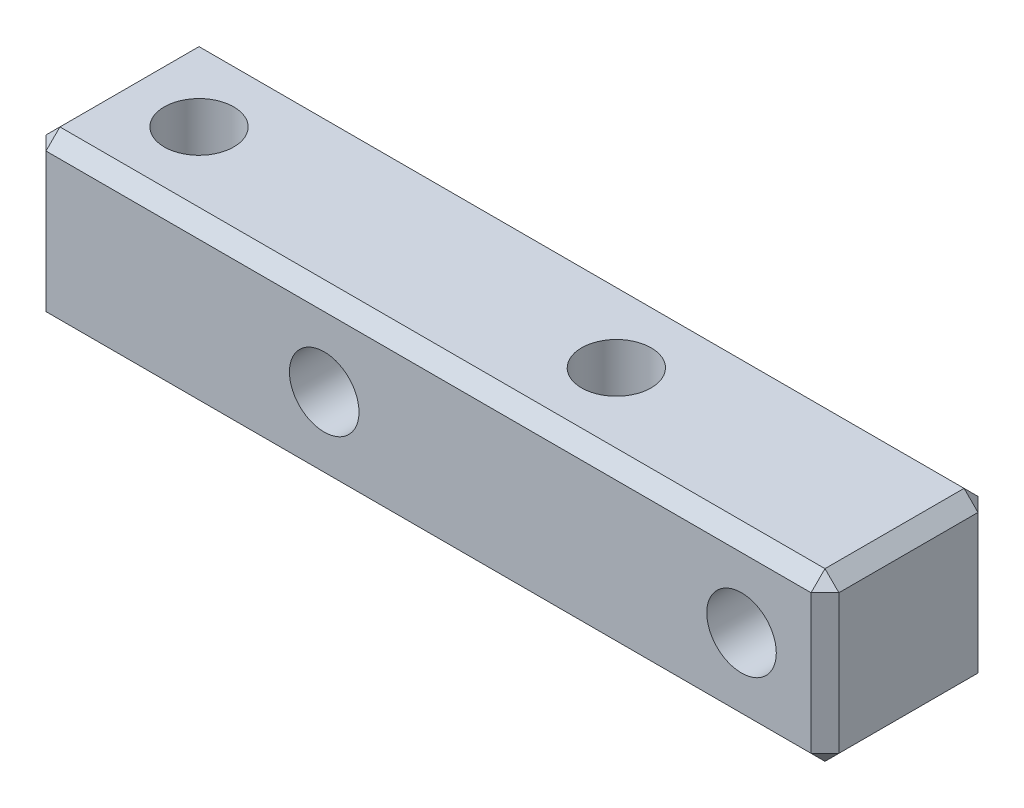
ISO-10303-21;
HEADER;
FILE_DESCRIPTION(('STEP AP214'),'2;1');
FILE_NAME('part.step','',(''),(''),'','','');
FILE_SCHEMA(('AUTOMOTIVE_DESIGN { 1 0 10303 214 1 1 1 1 }'));
ENDSEC;
DATA;
#1=APPLICATION_CONTEXT('core data for automotive mechanical design processes');
#2=APPLICATION_PROTOCOL_DEFINITION('international standard','automotive_design',2000,#1);
#3=PRODUCT_CONTEXT('',#1,'mechanical');
#4=PRODUCT('Part','Part','',(#3));
#5=PRODUCT_RELATED_PRODUCT_CATEGORY('part','',(#4));
#6=PRODUCT_DEFINITION_FORMATION('','',#4);
#7=PRODUCT_DEFINITION_CONTEXT('part definition',#1,'design');
#8=PRODUCT_DEFINITION('design','',#6,#7);
#9=PRODUCT_DEFINITION_SHAPE('','',#8);
#10=(LENGTH_UNIT() NAMED_UNIT(*) SI_UNIT(.MILLI.,.METRE.));
#11=(NAMED_UNIT(*) PLANE_ANGLE_UNIT() SI_UNIT($,.RADIAN.));
#12=(NAMED_UNIT(*) SI_UNIT($,.STERADIAN.) SOLID_ANGLE_UNIT());
#13=UNCERTAINTY_MEASURE_WITH_UNIT(LENGTH_MEASURE(1.E-05),#10,'distance_accuracy_value','');
#14=(GEOMETRIC_REPRESENTATION_CONTEXT(3) GLOBAL_UNCERTAINTY_ASSIGNED_CONTEXT((#13)) GLOBAL_UNIT_ASSIGNED_CONTEXT((#10,
#11,#12)) REPRESENTATION_CONTEXT('',''));
#15=CARTESIAN_POINT('',(0.,0.,0.));
#16=DIRECTION('',(0.,0.,1.));
#17=DIRECTION('',(1.,0.,0.));
#18=AXIS2_PLACEMENT_3D('',#15,#16,#17);
#19=CARTESIAN_POINT('',(0.,0.,3.));
#20=DIRECTION('',(0.,0.,-1.));
#21=DIRECTION('',(-1.,0.,0.));
#22=AXIS2_PLACEMENT_3D('',#19,#20,#21);
#23=PLANE('',#22);
#24=DIRECTION('',(-1.,0.,0.));
#25=VECTOR('',#24,1.);
#26=CARTESIAN_POINT('',(0.,2.5,3.));
#27=LINE('',#26,#25);
#28=CARTESIAN_POINT('',(2.5,2.5,3.));
#29=VERTEX_POINT('',#28);
#30=CARTESIAN_POINT('',(-25.,2.5,3.));
#31=VERTEX_POINT('',#30);
#32=EDGE_CURVE('E174',#29,#31,#27,.T.);
#33=ORIENTED_EDGE('',*,*,#32,.T.);
#34=DIRECTION('',(0.,-1.,0.));
#35=VECTOR('',#34,1.);
#36=CARTESIAN_POINT('',(-25.,0.,3.));
#37=LINE('',#36,#35);
#38=CARTESIAN_POINT('',(-25.,-2.5,3.));
#39=VERTEX_POINT('',#38);
#40=EDGE_CURVE('E180',#31,#39,#37,.T.);
#41=ORIENTED_EDGE('',*,*,#40,.T.);
#42=DIRECTION('',(1.,0.,0.));
#43=VECTOR('',#42,1.);
#44=CARTESIAN_POINT('',(0.,-2.5,3.));
#45=LINE('',#44,#43);
#46=CARTESIAN_POINT('',(2.5,-2.5,3.));
#47=VERTEX_POINT('',#46);
#48=EDGE_CURVE('E178',#39,#47,#45,.T.);
#49=ORIENTED_EDGE('',*,*,#48,.T.);
#50=DIRECTION('',(0.,1.,0.));
#51=VECTOR('',#50,1.);
#52=CARTESIAN_POINT('',(2.5,0.,3.));
#53=LINE('',#52,#51);
#54=EDGE_CURVE('E176',#47,#29,#53,.T.);
#55=ORIENTED_EDGE('',*,*,#54,.T.);
#56=EDGE_LOOP('',(#33,#41,#49,#55));
#57=FACE_BOUND('',#56,.T.);
#58=CARTESIAN_POINT('',(0.,0.,3.));
#59=DIRECTION('',(0.,0.,1.));
#60=DIRECTION('',(1.,0.,0.));
#61=AXIS2_PLACEMENT_3D('',#58,#59,#60);
#62=CIRCLE('',#61,1.25);
#63=CARTESIAN_POINT('',(1.25,0.,3.));
#64=VERTEX_POINT('',#63);
#65=EDGE_CURVE('E279',#64,#64,#62,.T.);
#66=ORIENTED_EDGE('',*,*,#65,.F.);
#67=EDGE_LOOP('',(#66));
#68=FACE_BOUND('',#67,.T.);
#69=CARTESIAN_POINT('',(-15.,0.,3.));
#70=DIRECTION('',(0.,0.,1.));
#71=DIRECTION('',(1.,0.,0.));
#72=AXIS2_PLACEMENT_3D('',#69,#70,#71);
#73=CIRCLE('',#72,1.25);
#74=CARTESIAN_POINT('',(-13.75,0.,3.));
#75=VERTEX_POINT('',#74);
#76=EDGE_CURVE('E285',#75,#75,#73,.T.);
#77=ORIENTED_EDGE('',*,*,#76,.F.);
#78=EDGE_LOOP('',(#77));
#79=FACE_BOUND('',#78,.T.);
#80=ADVANCED_FACE('F36',(#57,#68,#79),#23,.F.);
#81=CARTESIAN_POINT('',(0.,0.,-3.));
#82=DIRECTION('',(0.,0.,-1.));
#83=DIRECTION('',(-1.,0.,0.));
#84=AXIS2_PLACEMENT_3D('',#81,#82,#83);
#85=PLANE('',#84);
#86=DIRECTION('',(-1.,0.,0.));
#87=VECTOR('',#86,1.);
#88=CARTESIAN_POINT('',(-25.5,-2.5,-3.));
#89=LINE('',#88,#87);
#90=CARTESIAN_POINT('',(2.5,-2.5,-3.));
#91=VERTEX_POINT('',#90);
#92=CARTESIAN_POINT('',(-25.,-2.5,-3.));
#93=VERTEX_POINT('',#92);
#94=EDGE_CURVE('E196',#91,#93,#89,.T.);
#95=ORIENTED_EDGE('',*,*,#94,.T.);
#96=DIRECTION('',(0.,1.,0.));
#97=VECTOR('',#96,1.);
#98=CARTESIAN_POINT('',(-25.,3.,-3.));
#99=LINE('',#98,#97);
#100=CARTESIAN_POINT('',(-25.,2.5,-3.));
#101=VERTEX_POINT('',#100);
#102=EDGE_CURVE('E198',#93,#101,#99,.T.);
#103=ORIENTED_EDGE('',*,*,#102,.T.);
#104=DIRECTION('',(1.,0.,0.));
#105=VECTOR('',#104,1.);
#106=CARTESIAN_POINT('',(3.,2.5,-3.));
#107=LINE('',#106,#105);
#108=CARTESIAN_POINT('',(2.5,2.5,-3.));
#109=VERTEX_POINT('',#108);
#110=EDGE_CURVE('E192',#101,#109,#107,.T.);
#111=ORIENTED_EDGE('',*,*,#110,.T.);
#112=DIRECTION('',(0.,-1.,0.));
#113=VECTOR('',#112,1.);
#114=CARTESIAN_POINT('',(2.5,-3.,-3.));
#115=LINE('',#114,#113);
#116=EDGE_CURVE('E194',#109,#91,#115,.T.);
#117=ORIENTED_EDGE('',*,*,#116,.T.);
#118=EDGE_LOOP('',(#95,#103,#111,#117));
#119=FACE_BOUND('',#118,.T.);
#120=CARTESIAN_POINT('',(0.,0.,-3.));
#121=DIRECTION('',(0.,0.,1.));
#122=DIRECTION('',(1.,0.,0.));
#123=AXIS2_PLACEMENT_3D('',#120,#121,#122);
#124=CIRCLE('',#123,1.25);
#125=CARTESIAN_POINT('',(1.25,0.,-3.));
#126=VERTEX_POINT('',#125);
#127=EDGE_CURVE('E282',#126,#126,#124,.T.);
#128=ORIENTED_EDGE('',*,*,#127,.T.);
#129=EDGE_LOOP('',(#128));
#130=FACE_BOUND('',#129,.T.);
#131=CARTESIAN_POINT('',(-15.,0.,-3.));
#132=DIRECTION('',(0.,0.,1.));
#133=DIRECTION('',(1.,0.,0.));
#134=AXIS2_PLACEMENT_3D('',#131,#132,#133);
#135=CIRCLE('',#134,1.25);
#136=CARTESIAN_POINT('',(-13.75,0.,-3.));
#137=VERTEX_POINT('',#136);
#138=EDGE_CURVE('E157',#137,#137,#135,.T.);
#139=ORIENTED_EDGE('',*,*,#138,.T.);
#140=EDGE_LOOP('',(#139));
#141=FACE_BOUND('',#140,.T.);
#142=ADVANCED_FACE('F322',(#119,#130,#141),#85,.T.);
#143=CARTESIAN_POINT('',(-25.5,3.,3.));
#144=DIRECTION('',(0.,-1.,0.));
#145=DIRECTION('',(0.,0.,-1.));
#146=AXIS2_PLACEMENT_3D('',#143,#144,#145);
#147=PLANE('',#146);
#148=DIRECTION('',(-1.,0.,0.));
#149=VECTOR('',#148,1.);
#150=CARTESIAN_POINT('',(-25.5,3.,-2.5));
#151=LINE('',#150,#149);
#152=CARTESIAN_POINT('',(2.5,3.,-2.5));
#153=VERTEX_POINT('',#152);
#154=CARTESIAN_POINT('',(-25.,3.,-2.5));
#155=VERTEX_POINT('',#154);
#156=EDGE_CURVE('E171',#153,#155,#151,.T.);
#157=ORIENTED_EDGE('',*,*,#156,.T.);
#158=DIRECTION('',(0.,0.,1.));
#159=VECTOR('',#158,1.);
#160=CARTESIAN_POINT('',(-25.,3.,3.));
#161=LINE('',#160,#159);
#162=CARTESIAN_POINT('',(-25.,3.,2.5));
#163=VERTEX_POINT('',#162);
#164=EDGE_CURVE('E134',#155,#163,#161,.T.);
#165=ORIENTED_EDGE('',*,*,#164,.T.);
#166=DIRECTION('',(1.,0.,0.));
#167=VECTOR('',#166,1.);
#168=CARTESIAN_POINT('',(-25.5,3.,2.5));
#169=LINE('',#168,#167);
#170=CARTESIAN_POINT('',(2.5,3.,2.5));
#171=VERTEX_POINT('',#170);
#172=EDGE_CURVE('E163',#163,#171,#169,.T.);
#173=ORIENTED_EDGE('',*,*,#172,.T.);
#174=DIRECTION('',(0.,0.,-1.));
#175=VECTOR('',#174,1.);
#176=CARTESIAN_POINT('',(2.5,3.,3.));
#177=LINE('',#176,#175);
#178=EDGE_CURVE('E165',#171,#153,#177,.T.);
#179=ORIENTED_EDGE('',*,*,#178,.T.);
#180=EDGE_LOOP('',(#157,#165,#173,#179));
#181=FACE_BOUND('',#180,.T.);
#182=CARTESIAN_POINT('',(-7.5,3.,0.));
#183=DIRECTION('',(0.,1.,0.));
#184=DIRECTION('',(0.,0.,1.));
#185=AXIS2_PLACEMENT_3D('',#182,#183,#184);
#186=CIRCLE('',#185,1.25);
#187=CARTESIAN_POINT('',(-7.5,3.,1.25));
#188=VERTEX_POINT('',#187);
#189=EDGE_CURVE('E260',#188,#188,#186,.T.);
#190=ORIENTED_EDGE('',*,*,#189,.F.);
#191=EDGE_LOOP('',(#190));
#192=FACE_BOUND('',#191,.T.);
#193=CARTESIAN_POINT('',(-22.5,3.,0.));
#194=DIRECTION('',(0.,1.,0.));
#195=DIRECTION('',(0.,0.,1.));
#196=AXIS2_PLACEMENT_3D('',#193,#194,#195);
#197=CIRCLE('',#196,1.25);
#198=CARTESIAN_POINT('',(-22.5,3.,1.25));
#199=VERTEX_POINT('',#198);
#200=EDGE_CURVE('E271',#199,#199,#197,.T.);
#201=ORIENTED_EDGE('',*,*,#200,.F.);
#202=EDGE_LOOP('',(#201));
#203=FACE_BOUND('',#202,.T.);
#204=ADVANCED_FACE('F313',(#181,#192,#203),#147,.F.);
#205=CARTESIAN_POINT('',(-25.5,3.,3.));
#206=DIRECTION('',(1.,0.,0.));
#207=DIRECTION('',(0.,0.,-1.));
#208=AXIS2_PLACEMENT_3D('',#205,#206,#207);
#209=PLANE('',#208);
#210=DIRECTION('',(0.,1.,0.));
#211=VECTOR('',#210,1.);
#212=CARTESIAN_POINT('',(-25.5,3.,2.5));
#213=LINE('',#212,#211);
#214=CARTESIAN_POINT('',(-25.5,-2.5,2.5));
#215=VERTEX_POINT('',#214);
#216=CARTESIAN_POINT('',(-25.5,2.5,2.5));
#217=VERTEX_POINT('',#216);
#218=EDGE_CURVE('E161',#215,#217,#213,.T.);
#219=ORIENTED_EDGE('',*,*,#218,.T.);
#220=DIRECTION('',(0.,0.,-1.));
#221=VECTOR('',#220,1.);
#222=CARTESIAN_POINT('',(-25.5,2.5,3.));
#223=LINE('',#222,#221);
#224=CARTESIAN_POINT('',(-25.5,2.5,-2.5));
#225=VERTEX_POINT('',#224);
#226=EDGE_CURVE('E132',#217,#225,#223,.T.);
#227=ORIENTED_EDGE('',*,*,#226,.T.);
#228=DIRECTION('',(0.,-1.,0.));
#229=VECTOR('',#228,1.);
#230=CARTESIAN_POINT('',(-25.5,-3.,-2.5));
#231=LINE('',#230,#229);
#232=CARTESIAN_POINT('',(-25.5,-2.5,-2.5));
#233=VERTEX_POINT('',#232);
#234=EDGE_CURVE('E150',#225,#233,#231,.T.);
#235=ORIENTED_EDGE('',*,*,#234,.T.);
#236=DIRECTION('',(0.,0.,1.));
#237=VECTOR('',#236,1.);
#238=CARTESIAN_POINT('',(-25.5,-2.5,3.));
#239=LINE('',#238,#237);
#240=EDGE_CURVE('E156',#233,#215,#239,.T.);
#241=ORIENTED_EDGE('',*,*,#240,.T.);
#242=EDGE_LOOP('',(#219,#227,#235,#241));
#243=FACE_BOUND('',#242,.T.);
#244=ADVANCED_FACE('F159',(#243),#209,.F.);
#245=CARTESIAN_POINT('',(3.,-3.,3.));
#246=DIRECTION('',(0.,1.,0.));
#247=DIRECTION('',(-1.,0.,0.));
#248=AXIS2_PLACEMENT_3D('',#245,#246,#247);
#249=PLANE('',#248);
#250=DIRECTION('',(0.,0.,1.));
#251=VECTOR('',#250,1.);
#252=CARTESIAN_POINT('',(2.5,-3.,3.));
#253=LINE('',#252,#251);
#254=CARTESIAN_POINT('',(2.5,-3.,-2.5));
#255=VERTEX_POINT('',#254);
#256=CARTESIAN_POINT('',(2.5,-3.,2.5));
#257=VERTEX_POINT('',#256);
#258=EDGE_CURVE('E185',#255,#257,#253,.T.);
#259=ORIENTED_EDGE('',*,*,#258,.T.);
#260=DIRECTION('',(-1.,0.,0.));
#261=VECTOR('',#260,1.);
#262=CARTESIAN_POINT('',(3.,-3.,2.5));
#263=LINE('',#262,#261);
#264=CARTESIAN_POINT('',(-25.,-3.,2.5));
#265=VERTEX_POINT('',#264);
#266=EDGE_CURVE('E190',#257,#265,#263,.T.);
#267=ORIENTED_EDGE('',*,*,#266,.T.);
#268=DIRECTION('',(0.,0.,-1.));
#269=VECTOR('',#268,1.);
#270=CARTESIAN_POINT('',(-25.,-3.,3.));
#271=LINE('',#270,#269);
#272=CARTESIAN_POINT('',(-25.,-3.,-2.5));
#273=VERTEX_POINT('',#272);
#274=EDGE_CURVE('E187',#265,#273,#271,.T.);
#275=ORIENTED_EDGE('',*,*,#274,.T.);
#276=DIRECTION('',(1.,0.,0.));
#277=VECTOR('',#276,1.);
#278=CARTESIAN_POINT('',(3.,-3.,-2.5));
#279=LINE('',#278,#277);
#280=EDGE_CURVE('E183',#273,#255,#279,.T.);
#281=ORIENTED_EDGE('',*,*,#280,.T.);
#282=EDGE_LOOP('',(#259,#267,#275,#281));
#283=FACE_BOUND('',#282,.T.);
#284=CARTESIAN_POINT('',(-7.5,-3.,0.));
#285=DIRECTION('',(0.,1.,0.));
#286=DIRECTION('',(0.,0.,1.));
#287=AXIS2_PLACEMENT_3D('',#284,#285,#286);
#288=CIRCLE('',#287,1.25);
#289=CARTESIAN_POINT('',(-7.5,-3.,1.25));
#290=VERTEX_POINT('',#289);
#291=EDGE_CURVE('E266',#290,#290,#288,.T.);
#292=ORIENTED_EDGE('',*,*,#291,.T.);
#293=EDGE_LOOP('',(#292));
#294=FACE_BOUND('',#293,.T.);
#295=CARTESIAN_POINT('',(-22.5,-3.,0.));
#296=DIRECTION('',(0.,1.,0.));
#297=DIRECTION('',(0.,0.,1.));
#298=AXIS2_PLACEMENT_3D('',#295,#296,#297);
#299=CIRCLE('',#298,1.25);
#300=CARTESIAN_POINT('',(-22.5,-3.,1.25));
#301=VERTEX_POINT('',#300);
#302=EDGE_CURVE('E276',#301,#301,#299,.T.);
#303=ORIENTED_EDGE('',*,*,#302,.T.);
#304=EDGE_LOOP('',(#303));
#305=FACE_BOUND('',#304,.T.);
#306=ADVANCED_FACE('F357',(#283,#294,#305),#249,.F.);
#307=CARTESIAN_POINT('',(3.,3.,3.));
#308=DIRECTION('',(-1.,0.,0.));
#309=DIRECTION('',(0.,-1.,0.));
#310=AXIS2_PLACEMENT_3D('',#307,#308,#309);
#311=PLANE('',#310);
#312=DIRECTION('',(0.,-1.,0.));
#313=VECTOR('',#312,1.);
#314=CARTESIAN_POINT('',(3.,3.,2.5));
#315=LINE('',#314,#313);
#316=CARTESIAN_POINT('',(3.,2.5,2.5));
#317=VERTEX_POINT('',#316);
#318=CARTESIAN_POINT('',(3.,-2.5,2.5));
#319=VERTEX_POINT('',#318);
#320=EDGE_CURVE('E45',#317,#319,#315,.T.);
#321=ORIENTED_EDGE('',*,*,#320,.T.);
#322=DIRECTION('',(0.,0.,-1.));
#323=VECTOR('',#322,1.);
#324=CARTESIAN_POINT('',(3.,-2.5,3.));
#325=LINE('',#324,#323);
#326=CARTESIAN_POINT('',(3.,-2.5,-2.5));
#327=VERTEX_POINT('',#326);
#328=EDGE_CURVE('E11',#319,#327,#325,.T.);
#329=ORIENTED_EDGE('',*,*,#328,.T.);
#330=DIRECTION('',(0.,1.,0.));
#331=VECTOR('',#330,1.);
#332=CARTESIAN_POINT('',(3.,3.,-2.5));
#333=LINE('',#332,#331);
#334=CARTESIAN_POINT('',(3.,2.5,-2.5));
#335=VERTEX_POINT('',#334);
#336=EDGE_CURVE('E59',#327,#335,#333,.T.);
#337=ORIENTED_EDGE('',*,*,#336,.T.);
#338=DIRECTION('',(0.,0.,1.));
#339=VECTOR('',#338,1.);
#340=CARTESIAN_POINT('',(3.,2.5,3.));
#341=LINE('',#340,#339);
#342=EDGE_CURVE('E201',#335,#317,#341,.T.);
#343=ORIENTED_EDGE('',*,*,#342,.T.);
#344=EDGE_LOOP('',(#321,#329,#337,#343));
#345=FACE_BOUND('',#344,.T.);
#346=ADVANCED_FACE('F354',(#345),#311,.F.);
#347=CARTESIAN_POINT('',(-15.,0.,3.));
#348=DIRECTION('',(0.,0.,1.));
#349=DIRECTION('',(1.,0.,0.));
#350=AXIS2_PLACEMENT_3D('',#347,#348,#349);
#351=CYLINDRICAL_SURFACE('',#350,1.25);
#352=ORIENTED_EDGE('',*,*,#138,.F.);
#353=EDGE_LOOP('',(#352));
#354=FACE_BOUND('',#353,.T.);
#355=ORIENTED_EDGE('',*,*,#76,.T.);
#356=EDGE_LOOP('',(#355));
#357=FACE_BOUND('',#356,.T.);
#358=ADVANCED_FACE('F351',(#354,#357),#351,.F.);
#359=CARTESIAN_POINT('',(0.,0.,3.));
#360=DIRECTION('',(0.,0.,1.));
#361=DIRECTION('',(1.,0.,0.));
#362=AXIS2_PLACEMENT_3D('',#359,#360,#361);
#363=CYLINDRICAL_SURFACE('',#362,1.25);
#364=ORIENTED_EDGE('',*,*,#127,.F.);
#365=EDGE_LOOP('',(#364));
#366=FACE_BOUND('',#365,.T.);
#367=ORIENTED_EDGE('',*,*,#65,.T.);
#368=EDGE_LOOP('',(#367));
#369=FACE_BOUND('',#368,.T.);
#370=ADVANCED_FACE('F532',(#366,#369),#363,.F.);
#371=CARTESIAN_POINT('',(-22.5,3.,0.));
#372=DIRECTION('',(0.,1.,0.));
#373=DIRECTION('',(0.,0.,1.));
#374=AXIS2_PLACEMENT_3D('',#371,#372,#373);
#375=CYLINDRICAL_SURFACE('',#374,1.25);
#376=ORIENTED_EDGE('',*,*,#302,.F.);
#377=EDGE_LOOP('',(#376));
#378=FACE_BOUND('',#377,.T.);
#379=ORIENTED_EDGE('',*,*,#200,.T.);
#380=EDGE_LOOP('',(#379));
#381=FACE_BOUND('',#380,.T.);
#382=ADVANCED_FACE('F522',(#378,#381),#375,.F.);
#383=CARTESIAN_POINT('',(-7.5,3.,0.));
#384=DIRECTION('',(0.,1.,0.));
#385=DIRECTION('',(0.,0.,1.));
#386=AXIS2_PLACEMENT_3D('',#383,#384,#385);
#387=CYLINDRICAL_SURFACE('',#386,1.25);
#388=ORIENTED_EDGE('',*,*,#291,.F.);
#389=EDGE_LOOP('',(#388));
#390=FACE_BOUND('',#389,.T.);
#391=ORIENTED_EDGE('',*,*,#189,.T.);
#392=EDGE_LOOP('',(#391));
#393=FACE_BOUND('',#392,.T.);
#394=ADVANCED_FACE('F513',(#390,#393),#387,.F.);
#395=CARTESIAN_POINT('',(3.,-2.5,3.));
#396=DIRECTION('',(-0.707106781186547,0.707106781186547,0.));
#397=DIRECTION('',(0.,0.,-1.));
#398=AXIS2_PLACEMENT_3D('',#395,#396,#397);
#399=PLANE('',#398);
#400=DIRECTION('',(-0.707106781186547,-0.707106781186547,0.));
#401=VECTOR('',#400,1.);
#402=CARTESIAN_POINT('',(2.5,-3.,2.5));
#403=LINE('',#402,#401);
#404=EDGE_CURVE('E40',#257,#319,#403,.F.);
#405=ORIENTED_EDGE('',*,*,#404,.F.);
#406=ORIENTED_EDGE('',*,*,#258,.F.);
#407=DIRECTION('',(0.707106781186548,0.707106781186548,0.));
#408=VECTOR('',#407,1.);
#409=CARTESIAN_POINT('',(3.,-2.5,-2.5));
#410=LINE('',#409,#408);
#411=EDGE_CURVE('E254',#327,#255,#410,.F.);
#412=ORIENTED_EDGE('',*,*,#411,.F.);
#413=ORIENTED_EDGE('',*,*,#328,.F.);
#414=EDGE_LOOP('',(#405,#406,#412,#413));
#415=FACE_BOUND('',#414,.T.);
#416=ADVANCED_FACE('F38',(#415),#399,.F.);
#417=CARTESIAN_POINT('',(2.5,-3.,2.5));
#418=DIRECTION('',(0.577350269189626,-0.577350269189626,0.577350269189626));
#419=DIRECTION('',(0.707106781186547,0.,-0.707106781186547));
#420=AXIS2_PLACEMENT_3D('',#417,#418,#419);
#421=PLANE('',#420);
#422=DIRECTION('',(0.,0.707106781186547,0.707106781186548));
#423=VECTOR('',#422,1.);
#424=CARTESIAN_POINT('',(2.5,-3.,2.5));
#425=LINE('',#424,#423);
#426=EDGE_CURVE('E249',#257,#47,#425,.T.);
#427=ORIENTED_EDGE('',*,*,#426,.F.);
#428=ORIENTED_EDGE('',*,*,#404,.T.);
#429=DIRECTION('',(0.707106781186548,0.,-0.707106781186547));
#430=VECTOR('',#429,1.);
#431=CARTESIAN_POINT('',(2.75,-2.5,2.75));
#432=LINE('',#431,#430);
#433=EDGE_CURVE('E252',#47,#319,#432,.T.);
#434=ORIENTED_EDGE('',*,*,#433,.F.);
#435=EDGE_LOOP('',(#427,#428,#434));
#436=FACE_BOUND('',#435,.T.);
#437=ADVANCED_FACE('F499',(#436),#421,.T.);
#438=CARTESIAN_POINT('',(3.,-2.5,-2.5));
#439=DIRECTION('',(0.577350269189626,-0.577350269189626,-0.577350269189626));
#440=DIRECTION('',(-0.707106781186548,0.,-0.707106781186547));
#441=AXIS2_PLACEMENT_3D('',#438,#439,#440);
#442=PLANE('',#441);
#443=DIRECTION('',(0.707106781186548,0.,0.707106781186547));
#444=VECTOR('',#443,1.);
#445=CARTESIAN_POINT('',(3.,-2.5,-2.5));
#446=LINE('',#445,#444);
#447=EDGE_CURVE('E244',#327,#91,#446,.F.);
#448=ORIENTED_EDGE('',*,*,#447,.F.);
#449=ORIENTED_EDGE('',*,*,#411,.T.);
#450=DIRECTION('',(0.,0.707106781186547,-0.707106781186548));
#451=VECTOR('',#450,1.);
#452=CARTESIAN_POINT('',(2.5,-2.75,-2.75));
#453=LINE('',#452,#451);
#454=EDGE_CURVE('E246',#91,#255,#453,.F.);
#455=ORIENTED_EDGE('',*,*,#454,.F.);
#456=EDGE_LOOP('',(#448,#449,#455));
#457=FACE_BOUND('',#456,.T.);
#458=ADVANCED_FACE('F490',(#457),#442,.T.);
#459=CARTESIAN_POINT('',(2.5,0.,3.));
#460=DIRECTION('',(-0.707106781186547,0.,-0.707106781186548));
#461=DIRECTION('',(0.,1.,0.));
#462=AXIS2_PLACEMENT_3D('',#459,#460,#461);
#463=PLANE('',#462);
#464=ORIENTED_EDGE('',*,*,#433,.T.);
#465=ORIENTED_EDGE('',*,*,#320,.F.);
#466=DIRECTION('',(-0.707106781186548,0.,0.707106781186547));
#467=VECTOR('',#466,1.);
#468=CARTESIAN_POINT('',(2.5,2.5,3.));
#469=LINE('',#468,#467);
#470=EDGE_CURVE('E238',#29,#317,#469,.F.);
#471=ORIENTED_EDGE('',*,*,#470,.F.);
#472=ORIENTED_EDGE('',*,*,#54,.F.);
#473=EDGE_LOOP('',(#464,#465,#471,#472));
#474=FACE_BOUND('',#473,.T.);
#475=ADVANCED_FACE('F481',(#474),#463,.F.);
#476=CARTESIAN_POINT('',(0.,-2.5,3.));
#477=DIRECTION('',(0.,0.707106781186548,-0.707106781186547));
#478=DIRECTION('',(1.,0.,0.));
#479=AXIS2_PLACEMENT_3D('',#476,#477,#478);
#480=PLANE('',#479);
#481=ORIENTED_EDGE('',*,*,#426,.T.);
#482=ORIENTED_EDGE('',*,*,#48,.F.);
#483=DIRECTION('',(0.,-0.707106781186547,-0.707106781186547));
#484=VECTOR('',#483,1.);
#485=CARTESIAN_POINT('',(-25.,-2.5,3.));
#486=LINE('',#485,#484);
#487=EDGE_CURVE('E235',#265,#39,#486,.F.);
#488=ORIENTED_EDGE('',*,*,#487,.F.);
#489=ORIENTED_EDGE('',*,*,#266,.F.);
#490=EDGE_LOOP('',(#481,#482,#488,#489));
#491=FACE_BOUND('',#490,.T.);
#492=ADVANCED_FACE('F473',(#491),#480,.F.);
#493=CARTESIAN_POINT('',(-25.,-3.,3.));
#494=DIRECTION('',(0.707106781186547,0.707106781186547,0.));
#495=DIRECTION('',(0.,0.,-1.));
#496=AXIS2_PLACEMENT_3D('',#493,#494,#495);
#497=PLANE('',#496);
#498=DIRECTION('',(0.707106781186547,-0.707106781186547,0.));
#499=VECTOR('',#498,1.);
#500=CARTESIAN_POINT('',(-25.,-3.,-2.5));
#501=LINE('',#500,#499);
#502=EDGE_CURVE('E229',#273,#233,#501,.F.);
#503=ORIENTED_EDGE('',*,*,#502,.F.);
#504=ORIENTED_EDGE('',*,*,#274,.F.);
#505=DIRECTION('',(-0.707106781186547,0.707106781186547,0.));
#506=VECTOR('',#505,1.);
#507=CARTESIAN_POINT('',(-25.25,-2.75,2.5));
#508=LINE('',#507,#506);
#509=EDGE_CURVE('E232',#215,#265,#508,.F.);
#510=ORIENTED_EDGE('',*,*,#509,.F.);
#511=ORIENTED_EDGE('',*,*,#240,.F.);
#512=EDGE_LOOP('',(#503,#504,#510,#511));
#513=FACE_BOUND('',#512,.T.);
#514=ADVANCED_FACE('F294',(#513),#497,.F.);
#515=CARTESIAN_POINT('',(3.,-3.,-2.5));
#516=DIRECTION('',(0.,-0.707106781186548,-0.707106781186547));
#517=DIRECTION('',(-1.,0.,0.));
#518=AXIS2_PLACEMENT_3D('',#515,#516,#517);
#519=PLANE('',#518);
#520=ORIENTED_EDGE('',*,*,#454,.T.);
#521=ORIENTED_EDGE('',*,*,#280,.F.);
#522=DIRECTION('',(0.,-0.707106781186547,0.707106781186547));
#523=VECTOR('',#522,1.);
#524=CARTESIAN_POINT('',(-25.,-3.,-2.5));
#525=LINE('',#524,#523);
#526=EDGE_CURVE('E227',#93,#273,#525,.T.);
#527=ORIENTED_EDGE('',*,*,#526,.F.);
#528=ORIENTED_EDGE('',*,*,#94,.F.);
#529=EDGE_LOOP('',(#520,#521,#527,#528));
#530=FACE_BOUND('',#529,.T.);
#531=ADVANCED_FACE('F328',(#530),#519,.T.);
#532=CARTESIAN_POINT('',(3.,3.,-2.5));
#533=DIRECTION('',(0.707106781186547,0.,-0.707106781186548));
#534=DIRECTION('',(0.,-1.,0.));
#535=AXIS2_PLACEMENT_3D('',#532,#533,#534);
#536=PLANE('',#535);
#537=ORIENTED_EDGE('',*,*,#447,.T.);
#538=ORIENTED_EDGE('',*,*,#116,.F.);
#539=DIRECTION('',(-0.707106781186548,0.,-0.707106781186547));
#540=VECTOR('',#539,1.);
#541=CARTESIAN_POINT('',(3.,2.5,-2.5));
#542=LINE('',#541,#540);
#543=EDGE_CURVE('E224',#335,#109,#542,.T.);
#544=ORIENTED_EDGE('',*,*,#543,.F.);
#545=ORIENTED_EDGE('',*,*,#336,.F.);
#546=EDGE_LOOP('',(#537,#538,#544,#545));
#547=FACE_BOUND('',#546,.T.);
#548=ADVANCED_FACE('F450',(#547),#536,.T.);
#549=CARTESIAN_POINT('',(2.5,3.,3.));
#550=DIRECTION('',(-0.707106781186547,-0.707106781186547,0.));
#551=DIRECTION('',(0.,0.,-1.));
#552=AXIS2_PLACEMENT_3D('',#549,#550,#551);
#553=PLANE('',#552);
#554=DIRECTION('',(0.707106781186547,-0.707106781186547,0.));
#555=VECTOR('',#554,1.);
#556=CARTESIAN_POINT('',(2.75,2.75,2.5));
#557=LINE('',#556,#555);
#558=EDGE_CURVE('E241',#317,#171,#557,.F.);
#559=ORIENTED_EDGE('',*,*,#558,.F.);
#560=ORIENTED_EDGE('',*,*,#342,.F.);
#561=DIRECTION('',(-0.707106781186548,0.707106781186548,0.));
#562=VECTOR('',#561,1.);
#563=CARTESIAN_POINT('',(3.,2.5,-2.5));
#564=LINE('',#563,#562);
#565=EDGE_CURVE('E221',#153,#335,#564,.F.);
#566=ORIENTED_EDGE('',*,*,#565,.F.);
#567=ORIENTED_EDGE('',*,*,#178,.F.);
#568=EDGE_LOOP('',(#559,#560,#566,#567));
#569=FACE_BOUND('',#568,.T.);
#570=ADVANCED_FACE('F441',(#569),#553,.F.);
#571=CARTESIAN_POINT('',(2.5,2.5,3.));
#572=DIRECTION('',(0.577350269189626,0.577350269189626,0.577350269189626));
#573=DIRECTION('',(0.707106781186547,0.,-0.707106781186547));
#574=AXIS2_PLACEMENT_3D('',#571,#572,#573);
#575=PLANE('',#574);
#576=ORIENTED_EDGE('',*,*,#470,.T.);
#577=ORIENTED_EDGE('',*,*,#558,.T.);
#578=DIRECTION('',(0.,0.707106781186547,-0.707106781186547));
#579=VECTOR('',#578,1.);
#580=CARTESIAN_POINT('',(2.5,2.5,3.));
#581=LINE('',#580,#579);
#582=EDGE_CURVE('E218',#29,#171,#581,.T.);
#583=ORIENTED_EDGE('',*,*,#582,.F.);
#584=EDGE_LOOP('',(#576,#577,#583));
#585=FACE_BOUND('',#584,.T.);
#586=ADVANCED_FACE('F340',(#585),#575,.T.);
#587=CARTESIAN_POINT('',(-25.,-2.5,3.));
#588=DIRECTION('',(-0.577350269189626,-0.577350269189626,0.577350269189626));
#589=DIRECTION('',(0.707106781186547,0.,0.707106781186547));
#590=AXIS2_PLACEMENT_3D('',#587,#588,#589);
#591=PLANE('',#590);
#592=ORIENTED_EDGE('',*,*,#509,.T.);
#593=ORIENTED_EDGE('',*,*,#487,.T.);
#594=DIRECTION('',(0.707106781186547,0.,0.707106781186547));
#595=VECTOR('',#594,1.);
#596=CARTESIAN_POINT('',(-25.,-2.5,3.));
#597=LINE('',#596,#595);
#598=EDGE_CURVE('E216',#215,#39,#597,.T.);
#599=ORIENTED_EDGE('',*,*,#598,.F.);
#600=EDGE_LOOP('',(#592,#593,#599));
#601=FACE_BOUND('',#600,.T.);
#602=ADVANCED_FACE('F297',(#601),#591,.T.);
#603=CARTESIAN_POINT('',(-25.,-3.,-2.5));
#604=DIRECTION('',(-0.577350269189626,-0.577350269189626,-0.577350269189626));
#605=DIRECTION('',(-0.707106781186547,0.,0.707106781186547));
#606=AXIS2_PLACEMENT_3D('',#603,#604,#605);
#607=PLANE('',#606);
#608=ORIENTED_EDGE('',*,*,#526,.T.);
#609=ORIENTED_EDGE('',*,*,#502,.T.);
#610=DIRECTION('',(0.707106781186547,0.,-0.707106781186547));
#611=VECTOR('',#610,1.);
#612=CARTESIAN_POINT('',(-25.25,-2.5,-2.75));
#613=LINE('',#612,#611);
#614=EDGE_CURVE('E153',#93,#233,#613,.F.);
#615=ORIENTED_EDGE('',*,*,#614,.F.);
#616=EDGE_LOOP('',(#608,#609,#615));
#617=FACE_BOUND('',#616,.T.);
#618=ADVANCED_FACE('F330',(#617),#607,.T.);
#619=CARTESIAN_POINT('',(3.,2.5,-2.5));
#620=DIRECTION('',(0.577350269189626,0.577350269189626,-0.577350269189626));
#621=DIRECTION('',(-0.707106781186548,0.,-0.707106781186547));
#622=AXIS2_PLACEMENT_3D('',#619,#620,#621);
#623=PLANE('',#622);
#624=ORIENTED_EDGE('',*,*,#565,.T.);
#625=ORIENTED_EDGE('',*,*,#543,.T.);
#626=DIRECTION('',(0.,0.707106781186547,0.707106781186547));
#627=VECTOR('',#626,1.);
#628=CARTESIAN_POINT('',(2.5,2.75,-2.75));
#629=LINE('',#628,#627);
#630=EDGE_CURVE('E212',#153,#109,#629,.F.);
#631=ORIENTED_EDGE('',*,*,#630,.F.);
#632=EDGE_LOOP('',(#624,#625,#631));
#633=FACE_BOUND('',#632,.T.);
#634=ADVANCED_FACE('F332',(#633),#623,.T.);
#635=CARTESIAN_POINT('',(0.,2.5,3.));
#636=DIRECTION('',(0.,-0.707106781186547,-0.707106781186547));
#637=DIRECTION('',(-1.,0.,0.));
#638=AXIS2_PLACEMENT_3D('',#635,#636,#637);
#639=PLANE('',#638);
#640=ORIENTED_EDGE('',*,*,#582,.T.);
#641=ORIENTED_EDGE('',*,*,#172,.F.);
#642=DIRECTION('',(0.,-0.707106781186547,0.707106781186547));
#643=VECTOR('',#642,1.);
#644=CARTESIAN_POINT('',(-25.,3.,2.5));
#645=LINE('',#644,#643);
#646=EDGE_CURVE('E209',#31,#163,#645,.F.);
#647=ORIENTED_EDGE('',*,*,#646,.F.);
#648=ORIENTED_EDGE('',*,*,#32,.F.);
#649=EDGE_LOOP('',(#640,#641,#647,#648));
#650=FACE_BOUND('',#649,.T.);
#651=ADVANCED_FACE('F309',(#650),#639,.F.);
#652=CARTESIAN_POINT('',(-25.,0.,3.));
#653=DIRECTION('',(0.707106781186547,0.,-0.707106781186547));
#654=DIRECTION('',(0.,-1.,0.));
#655=AXIS2_PLACEMENT_3D('',#652,#653,#654);
#656=PLANE('',#655);
#657=ORIENTED_EDGE('',*,*,#598,.T.);
#658=ORIENTED_EDGE('',*,*,#40,.F.);
#659=DIRECTION('',(-0.707106781186547,0.,-0.707106781186547));
#660=VECTOR('',#659,1.);
#661=CARTESIAN_POINT('',(-25.25,2.5,2.75));
#662=LINE('',#661,#660);
#663=EDGE_CURVE('E147',#217,#31,#662,.F.);
#664=ORIENTED_EDGE('',*,*,#663,.F.);
#665=ORIENTED_EDGE('',*,*,#218,.F.);
#666=EDGE_LOOP('',(#657,#658,#664,#665));
#667=FACE_BOUND('',#666,.T.);
#668=ADVANCED_FACE('F301',(#667),#656,.F.);
#669=CARTESIAN_POINT('',(-25.5,3.,-2.5));
#670=DIRECTION('',(-0.707106781186547,0.,-0.707106781186547));
#671=DIRECTION('',(0.,1.,0.));
#672=AXIS2_PLACEMENT_3D('',#669,#670,#671);
#673=PLANE('',#672);
#674=ORIENTED_EDGE('',*,*,#614,.T.);
#675=ORIENTED_EDGE('',*,*,#234,.F.);
#676=DIRECTION('',(-0.707106781186547,0.,0.707106781186547));
#677=VECTOR('',#676,1.);
#678=CARTESIAN_POINT('',(-25.5,2.5,-2.5));
#679=LINE('',#678,#677);
#680=EDGE_CURVE('E139',#101,#225,#679,.T.);
#681=ORIENTED_EDGE('',*,*,#680,.F.);
#682=ORIENTED_EDGE('',*,*,#102,.F.);
#683=EDGE_LOOP('',(#674,#675,#681,#682));
#684=FACE_BOUND('',#683,.T.);
#685=ADVANCED_FACE('F151',(#684),#673,.T.);
#686=CARTESIAN_POINT('',(-25.5,3.,-2.5));
#687=DIRECTION('',(0.,0.707106781186547,-0.707106781186547));
#688=DIRECTION('',(1.,0.,0.));
#689=AXIS2_PLACEMENT_3D('',#686,#687,#688);
#690=PLANE('',#689);
#691=ORIENTED_EDGE('',*,*,#630,.T.);
#692=ORIENTED_EDGE('',*,*,#110,.F.);
#693=DIRECTION('',(0.,-0.707106781186547,-0.707106781186547));
#694=VECTOR('',#693,1.);
#695=CARTESIAN_POINT('',(-25.,2.75,-2.75));
#696=LINE('',#695,#694);
#697=EDGE_CURVE('E143',#155,#101,#696,.T.);
#698=ORIENTED_EDGE('',*,*,#697,.F.);
#699=ORIENTED_EDGE('',*,*,#156,.F.);
#700=EDGE_LOOP('',(#691,#692,#698,#699));
#701=FACE_BOUND('',#700,.T.);
#702=ADVANCED_FACE('F318',(#701),#690,.T.);
#703=CARTESIAN_POINT('',(-25.,3.,2.5));
#704=DIRECTION('',(-0.577350269189626,0.577350269189626,0.577350269189626));
#705=DIRECTION('',(0.707106781186547,0.,0.707106781186547));
#706=AXIS2_PLACEMENT_3D('',#703,#704,#705);
#707=PLANE('',#706);
#708=ORIENTED_EDGE('',*,*,#663,.T.);
#709=ORIENTED_EDGE('',*,*,#646,.T.);
#710=DIRECTION('',(0.707106781186547,0.707106781186547,0.));
#711=VECTOR('',#710,1.);
#712=CARTESIAN_POINT('',(-25.,3.,2.5));
#713=LINE('',#712,#711);
#714=EDGE_CURVE('E136',#217,#163,#713,.T.);
#715=ORIENTED_EDGE('',*,*,#714,.F.);
#716=EDGE_LOOP('',(#708,#709,#715));
#717=FACE_BOUND('',#716,.T.);
#718=ADVANCED_FACE('F305',(#717),#707,.T.);
#719=CARTESIAN_POINT('',(-25.5,2.5,-2.5));
#720=DIRECTION('',(-0.577350269189626,0.577350269189626,-0.577350269189626));
#721=DIRECTION('',(-0.707106781186547,0.,0.707106781186547));
#722=AXIS2_PLACEMENT_3D('',#719,#720,#721);
#723=PLANE('',#722);
#724=ORIENTED_EDGE('',*,*,#697,.T.);
#725=ORIENTED_EDGE('',*,*,#680,.T.);
#726=DIRECTION('',(-0.707106781186547,-0.707106781186547,0.));
#727=VECTOR('',#726,1.);
#728=CARTESIAN_POINT('',(-25.5,2.5,-2.5));
#729=LINE('',#728,#727);
#730=EDGE_CURVE('E128',#155,#225,#729,.T.);
#731=ORIENTED_EDGE('',*,*,#730,.F.);
#732=EDGE_LOOP('',(#724,#725,#731));
#733=FACE_BOUND('',#732,.T.);
#734=ADVANCED_FACE('F141',(#733),#723,.T.);
#735=CARTESIAN_POINT('',(-25.5,2.5,3.));
#736=DIRECTION('',(0.707106781186547,-0.707106781186547,0.));
#737=DIRECTION('',(0.,0.,-1.));
#738=AXIS2_PLACEMENT_3D('',#735,#736,#737);
#739=PLANE('',#738);
#740=ORIENTED_EDGE('',*,*,#714,.T.);
#741=ORIENTED_EDGE('',*,*,#164,.F.);
#742=ORIENTED_EDGE('',*,*,#730,.T.);
#743=ORIENTED_EDGE('',*,*,#226,.F.);
#744=EDGE_LOOP('',(#740,#741,#742,#743));
#745=FACE_BOUND('',#744,.T.);
#746=ADVANCED_FACE('F130',(#745),#739,.F.);
#747=CLOSED_SHELL('',(#80,#142,#204,#244,#306,#346,#358,#370,#382,#394,#416,#437,#458,#475,#492,
#514,#531,#548,#570,#586,#602,#618,#634,#651,#668,#685,#702,#718,#734,#746));
#748=MANIFOLD_SOLID_BREP('B2',#747);
#749=ADVANCED_BREP_SHAPE_REPRESENTATION('',(#18,#748),#14);
#750=SHAPE_DEFINITION_REPRESENTATION(#9,#749);
ENDSEC;
END-ISO-10303-21;
